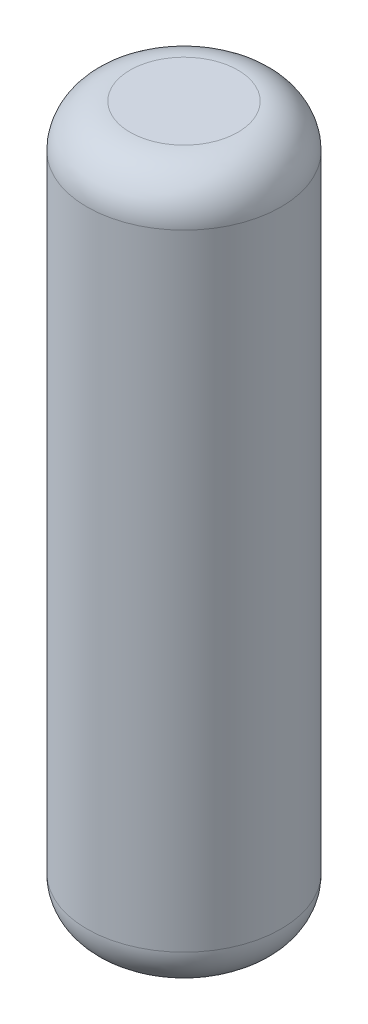
ISO-10303-21;
HEADER;
FILE_DESCRIPTION(('STEP AP214'),'2;1');
FILE_NAME('part.step','',(''),(''),'','','');
FILE_SCHEMA(('AUTOMOTIVE_DESIGN { 1 0 10303 214 1 1 1 1 }'));
ENDSEC;
DATA;
#1=APPLICATION_CONTEXT('core data for automotive mechanical design processes');
#2=APPLICATION_PROTOCOL_DEFINITION('international standard','automotive_design',2000,#1);
#3=PRODUCT_CONTEXT('',#1,'mechanical');
#4=PRODUCT('Part','Part','',(#3));
#5=PRODUCT_RELATED_PRODUCT_CATEGORY('part','',(#4));
#6=PRODUCT_DEFINITION_FORMATION('','',#4);
#7=PRODUCT_DEFINITION_CONTEXT('part definition',#1,'design');
#8=PRODUCT_DEFINITION('design','',#6,#7);
#9=PRODUCT_DEFINITION_SHAPE('','',#8);
#10=(LENGTH_UNIT() NAMED_UNIT(*) SI_UNIT(.MILLI.,.METRE.));
#11=(NAMED_UNIT(*) PLANE_ANGLE_UNIT() SI_UNIT($,.RADIAN.));
#12=(NAMED_UNIT(*) SI_UNIT($,.STERADIAN.) SOLID_ANGLE_UNIT());
#13=UNCERTAINTY_MEASURE_WITH_UNIT(LENGTH_MEASURE(1.E-05),#10,'distance_accuracy_value','');
#14=(GEOMETRIC_REPRESENTATION_CONTEXT(3) GLOBAL_UNCERTAINTY_ASSIGNED_CONTEXT((#13)) GLOBAL_UNIT_ASSIGNED_CONTEXT((#10,
#11,#12)) REPRESENTATION_CONTEXT('',''));
#15=CARTESIAN_POINT('',(0.,0.,0.));
#16=DIRECTION('',(0.,0.,1.));
#17=DIRECTION('',(1.,0.,0.));
#18=AXIS2_PLACEMENT_3D('',#15,#16,#17);
#19=CARTESIAN_POINT('',(0.,16.5,0.));
#20=DIRECTION('',(0.,-1.,0.));
#21=DIRECTION('',(0.,0.,-1.));
#22=AXIS2_PLACEMENT_3D('',#19,#20,#21);
#23=CYLINDRICAL_SURFACE('',#22,2.25);
#24=CARTESIAN_POINT('',(0.,1.,0.));
#25=DIRECTION('',(0.,1.,0.));
#26=DIRECTION('',(0.,0.,1.));
#27=AXIS2_PLACEMENT_3D('',#24,#25,#26);
#28=CIRCLE('',#27,2.25);
#29=CARTESIAN_POINT('',(0.,1.,2.25));
#30=VERTEX_POINT('',#29);
#31=EDGE_CURVE('E56',#30,#30,#28,.T.);
#32=ORIENTED_EDGE('',*,*,#31,.T.);
#33=EDGE_LOOP('',(#32));
#34=FACE_BOUND('',#33,.T.);
#35=CARTESIAN_POINT('',(0.,15.5,0.));
#36=DIRECTION('',(0.,1.,0.));
#37=DIRECTION('',(0.,0.,1.));
#38=AXIS2_PLACEMENT_3D('',#35,#36,#37);
#39=CIRCLE('',#38,2.25);
#40=CARTESIAN_POINT('',(0.,15.5,2.25));
#41=VERTEX_POINT('',#40);
#42=EDGE_CURVE('E61',#41,#41,#39,.F.);
#43=ORIENTED_EDGE('',*,*,#42,.T.);
#44=EDGE_LOOP('',(#43));
#45=FACE_BOUND('',#44,.T.);
#46=ADVANCED_FACE('F43',(#34,#45),#23,.T.);
#47=CARTESIAN_POINT('',(0.,16.5,0.));
#48=DIRECTION('',(0.,1.,0.));
#49=DIRECTION('',(0.,0.,1.));
#50=AXIS2_PLACEMENT_3D('',#47,#48,#49);
#51=PLANE('',#50);
#52=CARTESIAN_POINT('',(0.,16.5,0.));
#53=DIRECTION('',(0.,1.,0.));
#54=DIRECTION('',(0.,0.,1.));
#55=AXIS2_PLACEMENT_3D('',#52,#53,#54);
#56=CIRCLE('',#55,1.25);
#57=CARTESIAN_POINT('',(0.,16.5,1.25));
#58=VERTEX_POINT('',#57);
#59=EDGE_CURVE('E10',#58,#58,#56,.T.);
#60=ORIENTED_EDGE('',*,*,#59,.T.);
#61=EDGE_LOOP('',(#60));
#62=FACE_BOUND('',#61,.T.);
#63=ADVANCED_FACE('F78',(#62),#51,.T.);
#64=CARTESIAN_POINT('',(0.,0.,0.));
#65=DIRECTION('',(0.,1.,0.));
#66=DIRECTION('',(0.,0.,1.));
#67=AXIS2_PLACEMENT_3D('',#64,#65,#66);
#68=PLANE('',#67);
#69=CARTESIAN_POINT('',(0.,0.,0.));
#70=DIRECTION('',(0.,1.,0.));
#71=DIRECTION('',(0.,0.,1.));
#72=AXIS2_PLACEMENT_3D('',#69,#70,#71);
#73=CIRCLE('',#72,1.25);
#74=CARTESIAN_POINT('',(0.,0.,1.25));
#75=VERTEX_POINT('',#74);
#76=EDGE_CURVE('E51',#75,#75,#73,.F.);
#77=ORIENTED_EDGE('',*,*,#76,.T.);
#78=EDGE_LOOP('',(#77));
#79=FACE_BOUND('',#78,.T.);
#80=ADVANCED_FACE('F75',(#79),#68,.F.);
#81=CARTESIAN_POINT('',(0.,1.,0.));
#82=DIRECTION('',(0.,1.,0.));
#83=DIRECTION('',(0.,0.,1.));
#84=AXIS2_PLACEMENT_3D('',#81,#82,#83);
#85=TOROIDAL_SURFACE('',#84,1.25,1.);
#86=ORIENTED_EDGE('',*,*,#76,.F.);
#87=EDGE_LOOP('',(#86));
#88=FACE_BOUND('',#87,.T.);
#89=ORIENTED_EDGE('',*,*,#31,.F.);
#90=EDGE_LOOP('',(#89));
#91=FACE_BOUND('',#90,.T.);
#92=ADVANCED_FACE('F71',(#88,#91),#85,.T.);
#93=CARTESIAN_POINT('',(0.,15.5,0.));
#94=DIRECTION('',(0.,1.,0.));
#95=DIRECTION('',(0.,0.,1.));
#96=AXIS2_PLACEMENT_3D('',#93,#94,#95);
#97=TOROIDAL_SURFACE('',#96,1.25,1.);
#98=ORIENTED_EDGE('',*,*,#42,.F.);
#99=EDGE_LOOP('',(#98));
#100=FACE_BOUND('',#99,.T.);
#101=ORIENTED_EDGE('',*,*,#59,.F.);
#102=EDGE_LOOP('',(#101));
#103=FACE_BOUND('',#102,.T.);
#104=ADVANCED_FACE('F45',(#100,#103),#97,.T.);
#105=CLOSED_SHELL('',(#46,#63,#80,#92,#104));
#106=MANIFOLD_SOLID_BREP('B2',#105);
#107=ADVANCED_BREP_SHAPE_REPRESENTATION('',(#18,#106),#14);
#108=SHAPE_DEFINITION_REPRESENTATION(#9,#107);
ENDSEC;
END-ISO-10303-21;
